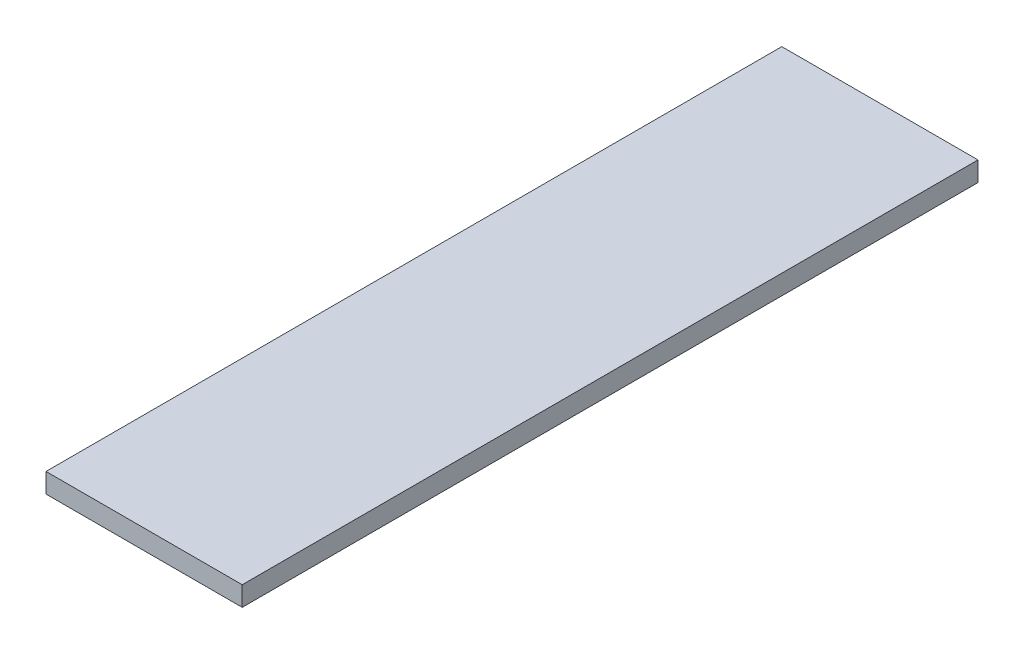
ISO-10303-21;
HEADER;
FILE_DESCRIPTION(('STEP AP214'),'2;1');
FILE_NAME('part.step','',(''),(''),'','','');
FILE_SCHEMA(('AUTOMOTIVE_DESIGN { 1 0 10303 214 1 1 1 1 }'));
ENDSEC;
DATA;
#1=APPLICATION_CONTEXT('core data for automotive mechanical design processes');
#2=APPLICATION_PROTOCOL_DEFINITION('international standard','automotive_design',2000,#1);
#3=PRODUCT_CONTEXT('',#1,'mechanical');
#4=PRODUCT('Part','Part','',(#3));
#5=PRODUCT_RELATED_PRODUCT_CATEGORY('part','',(#4));
#6=PRODUCT_DEFINITION_FORMATION('','',#4);
#7=PRODUCT_DEFINITION_CONTEXT('part definition',#1,'design');
#8=PRODUCT_DEFINITION('design','',#6,#7);
#9=PRODUCT_DEFINITION_SHAPE('','',#8);
#10=(LENGTH_UNIT() NAMED_UNIT(*) SI_UNIT(.MILLI.,.METRE.));
#11=(NAMED_UNIT(*) PLANE_ANGLE_UNIT() SI_UNIT($,.RADIAN.));
#12=(NAMED_UNIT(*) SI_UNIT($,.STERADIAN.) SOLID_ANGLE_UNIT());
#13=UNCERTAINTY_MEASURE_WITH_UNIT(LENGTH_MEASURE(1.E-05),#10,'distance_accuracy_value','');
#14=(GEOMETRIC_REPRESENTATION_CONTEXT(3) GLOBAL_UNCERTAINTY_ASSIGNED_CONTEXT((#13)) GLOBAL_UNIT_ASSIGNED_CONTEXT((#10,
#11,#12)) REPRESENTATION_CONTEXT('',''));
#15=CARTESIAN_POINT('',(0.,0.,0.));
#16=DIRECTION('',(0.,0.,1.));
#17=DIRECTION('',(1.,0.,0.));
#18=AXIS2_PLACEMENT_3D('',#15,#16,#17);
#19=CARTESIAN_POINT('',(-239.798141460186,53.6259541984733,750.));
#20=DIRECTION('',(1.,0.,0.));
#21=DIRECTION('',(0.,0.,-1.));
#22=AXIS2_PLACEMENT_3D('',#19,#20,#21);
#23=PLANE('',#22);
#24=DIRECTION('',(0.,-1.,0.));
#25=VECTOR('',#24,1.);
#26=CARTESIAN_POINT('',(-239.798141460186,53.6259541984733,0.));
#27=LINE('',#26,#25);
#28=CARTESIAN_POINT('',(-239.798141460186,53.6259541984733,0.));
#29=VERTEX_POINT('',#28);
#30=CARTESIAN_POINT('',(-239.798141460186,33.6259541984733,0.));
#31=VERTEX_POINT('',#30);
#32=EDGE_CURVE('E107',#29,#31,#27,.T.);
#33=ORIENTED_EDGE('',*,*,#32,.T.);
#34=DIRECTION('',(0.,0.,-1.));
#35=VECTOR('',#34,1.);
#36=CARTESIAN_POINT('',(-239.798141460186,33.6259541984733,750.));
#37=LINE('',#36,#35);
#38=CARTESIAN_POINT('',(-239.798141460186,33.6259541984733,750.));
#39=VERTEX_POINT('',#38);
#40=EDGE_CURVE('E11',#39,#31,#37,.T.);
#41=ORIENTED_EDGE('',*,*,#40,.F.);
#42=DIRECTION('',(0.,-1.,0.));
#43=VECTOR('',#42,1.);
#44=CARTESIAN_POINT('',(-239.798141460186,53.6259541984733,750.));
#45=LINE('',#44,#43);
#46=CARTESIAN_POINT('',(-239.798141460186,53.6259541984733,750.));
#47=VERTEX_POINT('',#46);
#48=EDGE_CURVE('E91',#47,#39,#45,.T.);
#49=ORIENTED_EDGE('',*,*,#48,.F.);
#50=DIRECTION('',(0.,0.,-1.));
#51=VECTOR('',#50,1.);
#52=CARTESIAN_POINT('',(-239.798141460186,53.6259541984733,750.));
#53=LINE('',#52,#51);
#54=EDGE_CURVE('E103',#47,#29,#53,.T.);
#55=ORIENTED_EDGE('',*,*,#54,.T.);
#56=EDGE_LOOP('',(#33,#41,#49,#55));
#57=FACE_BOUND('',#56,.T.);
#58=ADVANCED_FACE('F39',(#57),#23,.F.);
#59=CARTESIAN_POINT('',(-239.798141460186,33.6259541984733,750.));
#60=DIRECTION('',(0.,1.,0.));
#61=DIRECTION('',(0.,0.,1.));
#62=AXIS2_PLACEMENT_3D('',#59,#60,#61);
#63=PLANE('',#62);
#64=DIRECTION('',(1.,0.,0.));
#65=VECTOR('',#64,1.);
#66=CARTESIAN_POINT('',(-239.798141460186,33.6259541984733,0.));
#67=LINE('',#66,#65);
#68=CARTESIAN_POINT('',(-39.7981414601855,33.6259541984733,0.));
#69=VERTEX_POINT('',#68);
#70=EDGE_CURVE('E96',#31,#69,#67,.T.);
#71=ORIENTED_EDGE('',*,*,#70,.T.);
#72=DIRECTION('',(0.,0.,-1.));
#73=VECTOR('',#72,1.);
#74=CARTESIAN_POINT('',(-39.7981414601855,33.6259541984733,750.));
#75=LINE('',#74,#73);
#76=CARTESIAN_POINT('',(-39.7981414601855,33.6259541984733,750.));
#77=VERTEX_POINT('',#76);
#78=EDGE_CURVE('E48',#77,#69,#75,.T.);
#79=ORIENTED_EDGE('',*,*,#78,.F.);
#80=DIRECTION('',(1.,0.,0.));
#81=VECTOR('',#80,1.);
#82=CARTESIAN_POINT('',(-239.798141460186,33.6259541984733,750.));
#83=LINE('',#82,#81);
#84=EDGE_CURVE('E86',#39,#77,#83,.T.);
#85=ORIENTED_EDGE('',*,*,#84,.F.);
#86=ORIENTED_EDGE('',*,*,#40,.T.);
#87=EDGE_LOOP('',(#71,#79,#85,#86));
#88=FACE_BOUND('',#87,.T.);
#89=ADVANCED_FACE('F95',(#88),#63,.F.);
#90=CARTESIAN_POINT('',(-39.7981414601855,53.6259541984733,750.));
#91=DIRECTION('',(-1.,0.,0.));
#92=DIRECTION('',(0.,-1.,0.));
#93=AXIS2_PLACEMENT_3D('',#90,#91,#92);
#94=PLANE('',#93);
#95=DIRECTION('',(0.,1.,0.));
#96=VECTOR('',#95,1.);
#97=CARTESIAN_POINT('',(-39.7981414601855,53.6259541984733,0.));
#98=LINE('',#97,#96);
#99=CARTESIAN_POINT('',(-39.7981414601855,53.6259541984733,0.));
#100=VERTEX_POINT('',#99);
#101=EDGE_CURVE('E73',#69,#100,#98,.T.);
#102=ORIENTED_EDGE('',*,*,#101,.T.);
#103=DIRECTION('',(0.,0.,-1.));
#104=VECTOR('',#103,1.);
#105=CARTESIAN_POINT('',(-39.7981414601855,53.6259541984733,750.));
#106=LINE('',#105,#104);
#107=CARTESIAN_POINT('',(-39.7981414601855,53.6259541984733,750.));
#108=VERTEX_POINT('',#107);
#109=EDGE_CURVE('E98',#108,#100,#106,.T.);
#110=ORIENTED_EDGE('',*,*,#109,.F.);
#111=DIRECTION('',(0.,1.,0.));
#112=VECTOR('',#111,1.);
#113=CARTESIAN_POINT('',(-39.7981414601855,53.6259541984733,750.));
#114=LINE('',#113,#112);
#115=EDGE_CURVE('E89',#77,#108,#114,.T.);
#116=ORIENTED_EDGE('',*,*,#115,.F.);
#117=ORIENTED_EDGE('',*,*,#78,.T.);
#118=EDGE_LOOP('',(#102,#110,#116,#117));
#119=FACE_BOUND('',#118,.T.);
#120=ADVANCED_FACE('F99',(#119),#94,.F.);
#121=CARTESIAN_POINT('',(-239.798141460186,53.6259541984733,750.));
#122=DIRECTION('',(0.,-1.,0.));
#123=DIRECTION('',(0.,0.,-1.));
#124=AXIS2_PLACEMENT_3D('',#121,#122,#123);
#125=PLANE('',#124);
#126=DIRECTION('',(-1.,0.,0.));
#127=VECTOR('',#126,1.);
#128=CARTESIAN_POINT('',(-239.798141460186,53.6259541984733,0.));
#129=LINE('',#128,#127);
#130=EDGE_CURVE('E79',#100,#29,#129,.T.);
#131=ORIENTED_EDGE('',*,*,#130,.T.);
#132=ORIENTED_EDGE('',*,*,#54,.F.);
#133=DIRECTION('',(-1.,0.,0.));
#134=VECTOR('',#133,1.);
#135=CARTESIAN_POINT('',(-239.798141460186,53.6259541984733,750.));
#136=LINE('',#135,#134);
#137=EDGE_CURVE('E56',#108,#47,#136,.T.);
#138=ORIENTED_EDGE('',*,*,#137,.F.);
#139=ORIENTED_EDGE('',*,*,#109,.T.);
#140=EDGE_LOOP('',(#131,#132,#138,#139));
#141=FACE_BOUND('',#140,.T.);
#142=ADVANCED_FACE('F120',(#141),#125,.F.);
#143=CARTESIAN_POINT('',(0.,0.,750.));
#144=DIRECTION('',(0.,0.,1.));
#145=DIRECTION('',(1.,0.,0.));
#146=AXIS2_PLACEMENT_3D('',#143,#144,#145);
#147=PLANE('',#146);
#148=ORIENTED_EDGE('',*,*,#48,.T.);
#149=ORIENTED_EDGE('',*,*,#84,.T.);
#150=ORIENTED_EDGE('',*,*,#115,.T.);
#151=ORIENTED_EDGE('',*,*,#137,.T.);
#152=EDGE_LOOP('',(#148,#149,#150,#151));
#153=FACE_BOUND('',#152,.T.);
#154=ADVANCED_FACE('F87',(#153),#147,.T.);
#155=CARTESIAN_POINT('',(0.,0.,0.));
#156=DIRECTION('',(0.,0.,1.));
#157=DIRECTION('',(1.,0.,0.));
#158=AXIS2_PLACEMENT_3D('',#155,#156,#157);
#159=PLANE('',#158);
#160=ORIENTED_EDGE('',*,*,#32,.F.);
#161=ORIENTED_EDGE('',*,*,#130,.F.);
#162=ORIENTED_EDGE('',*,*,#101,.F.);
#163=ORIENTED_EDGE('',*,*,#70,.F.);
#164=EDGE_LOOP('',(#160,#161,#162,#163));
#165=FACE_BOUND('',#164,.T.);
#166=ADVANCED_FACE('F123',(#165),#159,.F.);
#167=CLOSED_SHELL('',(#58,#89,#120,#142,#154,#166));
#168=MANIFOLD_SOLID_BREP('B2',#167);
#169=ADVANCED_BREP_SHAPE_REPRESENTATION('',(#18,#168),#14);
#170=SHAPE_DEFINITION_REPRESENTATION(#9,#169);
ENDSEC;
END-ISO-10303-21;
